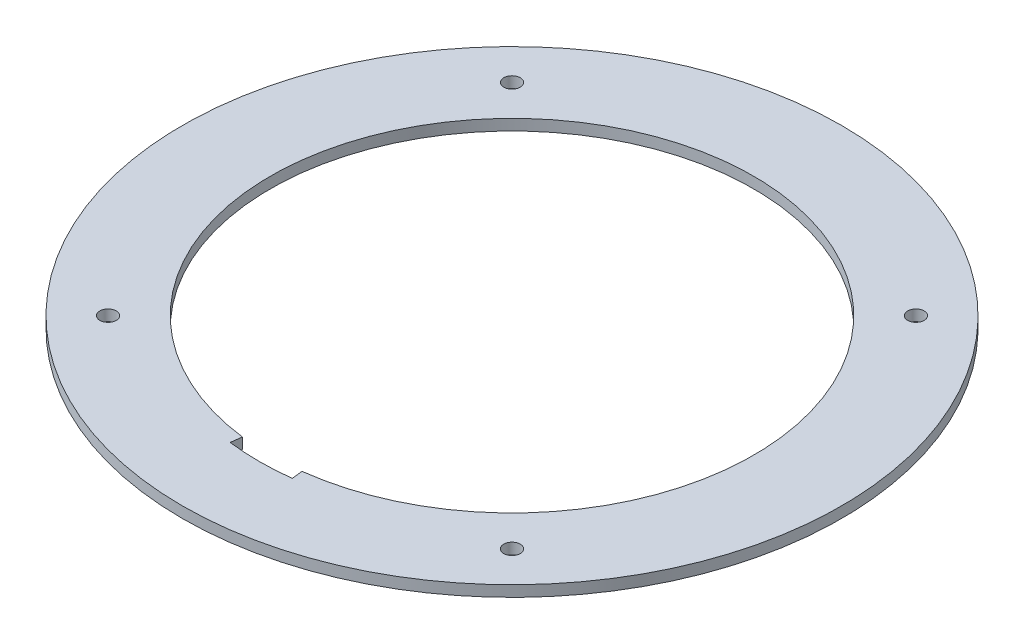
ISO-10303-21;
HEADER;
FILE_DESCRIPTION(('STEP AP214'),'2;1');
FILE_NAME('part.step','',(''),(''),'','','');
FILE_SCHEMA(('AUTOMOTIVE_DESIGN { 1 0 10303 214 1 1 1 1 }'));
ENDSEC;
DATA;
#1=APPLICATION_CONTEXT('core data for automotive mechanical design processes');
#2=APPLICATION_PROTOCOL_DEFINITION('international standard','automotive_design',2000,#1);
#3=PRODUCT_CONTEXT('',#1,'mechanical');
#4=PRODUCT('Part','Part','',(#3));
#5=PRODUCT_RELATED_PRODUCT_CATEGORY('part','',(#4));
#6=PRODUCT_DEFINITION_FORMATION('','',#4);
#7=PRODUCT_DEFINITION_CONTEXT('part definition',#1,'design');
#8=PRODUCT_DEFINITION('design','',#6,#7);
#9=PRODUCT_DEFINITION_SHAPE('','',#8);
#10=(LENGTH_UNIT() NAMED_UNIT(*) SI_UNIT(.MILLI.,.METRE.));
#11=(NAMED_UNIT(*) PLANE_ANGLE_UNIT() SI_UNIT($,.RADIAN.));
#12=(NAMED_UNIT(*) SI_UNIT($,.STERADIAN.) SOLID_ANGLE_UNIT());
#13=UNCERTAINTY_MEASURE_WITH_UNIT(LENGTH_MEASURE(1.E-05),#10,'distance_accuracy_value','');
#14=(GEOMETRIC_REPRESENTATION_CONTEXT(3) GLOBAL_UNCERTAINTY_ASSIGNED_CONTEXT((#13)) GLOBAL_UNIT_ASSIGNED_CONTEXT((#10,
#11,#12)) REPRESENTATION_CONTEXT('',''));
#15=CARTESIAN_POINT('',(0.,0.,0.));
#16=DIRECTION('',(0.,0.,1.));
#17=DIRECTION('',(1.,0.,0.));
#18=AXIS2_PLACEMENT_3D('',#15,#16,#17);
#19=CARTESIAN_POINT('',(0.,-2.,0.));
#20=DIRECTION('',(0.,1.,0.));
#21=DIRECTION('',(0.,0.,1.));
#22=AXIS2_PLACEMENT_3D('',#19,#20,#21);
#23=CYLINDRICAL_SURFACE('',#22,60.);
#24=CARTESIAN_POINT('',(0.,-2.,0.));
#25=DIRECTION('',(0.,1.,0.));
#26=DIRECTION('',(0.,0.,1.));
#27=AXIS2_PLACEMENT_3D('',#24,#25,#26);
#28=CIRCLE('',#27,60.);
#29=CARTESIAN_POINT('',(0.,-2.,60.));
#30=VERTEX_POINT('',#29);
#31=EDGE_CURVE('E11',#30,#30,#28,.T.);
#32=ORIENTED_EDGE('',*,*,#31,.T.);
#33=EDGE_LOOP('',(#32));
#34=FACE_BOUND('',#33,.T.);
#35=CARTESIAN_POINT('',(0.,0.,0.));
#36=DIRECTION('',(0.,1.,0.));
#37=DIRECTION('',(0.,0.,1.));
#38=AXIS2_PLACEMENT_3D('',#35,#36,#37);
#39=CIRCLE('',#38,60.);
#40=CARTESIAN_POINT('',(0.,0.,60.));
#41=VERTEX_POINT('',#40);
#42=EDGE_CURVE('E44',#41,#41,#39,.T.);
#43=ORIENTED_EDGE('',*,*,#42,.F.);
#44=EDGE_LOOP('',(#43));
#45=FACE_BOUND('',#44,.T.);
#46=ADVANCED_FACE('F41',(#34,#45),#23,.T.);
#47=CARTESIAN_POINT('',(0.,-2.,0.));
#48=DIRECTION('',(0.,1.,0.));
#49=DIRECTION('',(0.,0.,1.));
#50=AXIS2_PLACEMENT_3D('',#47,#48,#49);
#51=PLANE('',#50);
#52=CARTESIAN_POINT('',(-36.7695526217005,-2.,-36.7695526217005));
#53=DIRECTION('',(0.,1.,0.));
#54=DIRECTION('',(0.,0.,1.));
#55=AXIS2_PLACEMENT_3D('',#52,#53,#54);
#56=CIRCLE('',#55,1.5);
#57=CARTESIAN_POINT('',(-36.7695526217005,-2.,-35.2695526217005));
#58=VERTEX_POINT('',#57);
#59=EDGE_CURVE('E197',#58,#58,#56,.F.);
#60=ORIENTED_EDGE('',*,*,#59,.F.);
#61=EDGE_LOOP('',(#60));
#62=FACE_BOUND('',#61,.T.);
#63=CARTESIAN_POINT('',(36.7695526217005,-2.,36.7695526217005));
#64=DIRECTION('',(0.,1.,0.));
#65=DIRECTION('',(0.,0.,1.));
#66=AXIS2_PLACEMENT_3D('',#63,#64,#65);
#67=CIRCLE('',#66,1.5);
#68=CARTESIAN_POINT('',(36.7695526217005,-2.,38.2695526217005));
#69=VERTEX_POINT('',#68);
#70=EDGE_CURVE('E203',#69,#69,#67,.F.);
#71=ORIENTED_EDGE('',*,*,#70,.F.);
#72=EDGE_LOOP('',(#71));
#73=FACE_BOUND('',#72,.T.);
#74=CARTESIAN_POINT('',(-36.7695526217005,-2.,36.7695526217005));
#75=DIRECTION('',(0.,1.,0.));
#76=DIRECTION('',(0.,0.,1.));
#77=AXIS2_PLACEMENT_3D('',#74,#75,#76);
#78=CIRCLE('',#77,1.5);
#79=CARTESIAN_POINT('',(-36.7695526217005,-2.,38.2695526217005));
#80=VERTEX_POINT('',#79);
#81=EDGE_CURVE('E211',#80,#80,#78,.F.);
#82=ORIENTED_EDGE('',*,*,#81,.F.);
#83=EDGE_LOOP('',(#82));
#84=FACE_BOUND('',#83,.T.);
#85=CARTESIAN_POINT('',(36.7695526217005,-2.,-36.7695526217005));
#86=DIRECTION('',(0.,1.,0.));
#87=DIRECTION('',(0.,0.,1.));
#88=AXIS2_PLACEMENT_3D('',#85,#86,#87);
#89=CIRCLE('',#88,1.5);
#90=CARTESIAN_POINT('',(36.7695526217005,-2.,-35.2695526217005));
#91=VERTEX_POINT('',#90);
#92=EDGE_CURVE('E110',#91,#91,#89,.F.);
#93=ORIENTED_EDGE('',*,*,#92,.F.);
#94=EDGE_LOOP('',(#93));
#95=FACE_BOUND('',#94,.T.);
#96=DIRECTION('',(-0.123101981596663,0.,0.992394025640509));
#97=VECTOR('',#96,1.);
#98=CARTESIAN_POINT('',(-5.66269115344654,-2.,45.6501251794634));
#99=LINE('',#98,#97);
#100=CARTESIAN_POINT('',(-5.41648719025322,-2.,43.6653371281824));
#101=VERTEX_POINT('',#100);
#102=CARTESIAN_POINT('',(-5.66269115344654,-2.,45.6501251794634));
#103=VERTEX_POINT('',#102);
#104=EDGE_CURVE('E91',#101,#103,#99,.T.);
#105=ORIENTED_EDGE('',*,*,#104,.T.);
#106=CARTESIAN_POINT('',(0.,-2.,0.));
#107=DIRECTION('',(0.,1.,0.));
#108=DIRECTION('',(0.,0.,-1.));
#109=AXIS2_PLACEMENT_3D('',#106,#107,#108);
#110=CIRCLE('',#109,46.);
#111=CARTESIAN_POINT('',(5.66337383484554,-2.,45.6500404907464));
#112=VERTEX_POINT('',#111);
#113=EDGE_CURVE('E84',#103,#112,#110,.T.);
#114=ORIENTED_EDGE('',*,*,#113,.T.);
#115=DIRECTION('',(-0.123116822496641,0.,-0.992392184581444));
#116=VECTOR('',#115,1.);
#117=CARTESIAN_POINT('',(5.66337383484554,-2.,45.6500404907464));
#118=LINE('',#117,#116);
#119=CARTESIAN_POINT('',(5.41714018985226,-2.,43.6652561215835));
#120=VERTEX_POINT('',#119);
#121=EDGE_CURVE('E94',#112,#120,#118,.T.);
#122=ORIENTED_EDGE('',*,*,#121,.T.);
#123=CARTESIAN_POINT('',(0.,-2.,0.));
#124=DIRECTION('',(0.,1.,0.));
#125=DIRECTION('',(0.,0.,1.));
#126=AXIS2_PLACEMENT_3D('',#123,#124,#125);
#127=CIRCLE('',#126,44.);
#128=EDGE_CURVE('E56',#120,#101,#127,.T.);
#129=ORIENTED_EDGE('',*,*,#128,.T.);
#130=EDGE_LOOP('',(#105,#114,#122,#129));
#131=FACE_BOUND('',#130,.T.);
#132=ORIENTED_EDGE('',*,*,#31,.F.);
#133=EDGE_LOOP('',(#132));
#134=FACE_BOUND('',#133,.T.);
#135=ADVANCED_FACE('F99',(#62,#73,#84,#95,#131,#134),#51,.F.);
#136=CARTESIAN_POINT('',(0.,0.,0.));
#137=DIRECTION('',(0.,1.,0.));
#138=DIRECTION('',(0.,0.,1.));
#139=AXIS2_PLACEMENT_3D('',#136,#137,#138);
#140=PLANE('',#139);
#141=CARTESIAN_POINT('',(-36.7695526217005,0.,-36.7695526217005));
#142=DIRECTION('',(0.,1.,0.));
#143=DIRECTION('',(0.,0.,1.));
#144=AXIS2_PLACEMENT_3D('',#141,#142,#143);
#145=CIRCLE('',#144,1.5);
#146=CARTESIAN_POINT('',(-36.7695526217005,0.,-35.2695526217005));
#147=VERTEX_POINT('',#146);
#148=EDGE_CURVE('E194',#147,#147,#145,.T.);
#149=ORIENTED_EDGE('',*,*,#148,.F.);
#150=EDGE_LOOP('',(#149));
#151=FACE_BOUND('',#150,.T.);
#152=CARTESIAN_POINT('',(36.7695526217005,0.,36.7695526217005));
#153=DIRECTION('',(0.,1.,0.));
#154=DIRECTION('',(0.,0.,-1.));
#155=AXIS2_PLACEMENT_3D('',#152,#153,#154);
#156=CIRCLE('',#155,1.5);
#157=CARTESIAN_POINT('',(36.7695526217005,0.,35.2695526217005));
#158=VERTEX_POINT('',#157);
#159=EDGE_CURVE('E207',#158,#158,#156,.T.);
#160=ORIENTED_EDGE('',*,*,#159,.F.);
#161=EDGE_LOOP('',(#160));
#162=FACE_BOUND('',#161,.T.);
#163=CARTESIAN_POINT('',(-36.7695526217005,0.,36.7695526217005));
#164=DIRECTION('',(0.,1.,0.));
#165=DIRECTION('',(0.,0.,-1.));
#166=AXIS2_PLACEMENT_3D('',#163,#164,#165);
#167=CIRCLE('',#166,1.5);
#168=CARTESIAN_POINT('',(-36.7695526217005,0.,35.2695526217005));
#169=VERTEX_POINT('',#168);
#170=EDGE_CURVE('E226',#169,#169,#167,.T.);
#171=ORIENTED_EDGE('',*,*,#170,.F.);
#172=EDGE_LOOP('',(#171));
#173=FACE_BOUND('',#172,.T.);
#174=CARTESIAN_POINT('',(36.7695526217005,0.,-36.7695526217005));
#175=DIRECTION('',(0.,1.,0.));
#176=DIRECTION('',(0.,0.,1.));
#177=AXIS2_PLACEMENT_3D('',#174,#175,#176);
#178=CIRCLE('',#177,1.5);
#179=CARTESIAN_POINT('',(36.7695526217005,0.,-35.2695526217005));
#180=VERTEX_POINT('',#179);
#181=EDGE_CURVE('E199',#180,#180,#178,.T.);
#182=ORIENTED_EDGE('',*,*,#181,.F.);
#183=EDGE_LOOP('',(#182));
#184=FACE_BOUND('',#183,.T.);
#185=CARTESIAN_POINT('',(0.,0.,0.));
#186=DIRECTION('',(0.,1.,0.));
#187=DIRECTION('',(0.,0.,-1.));
#188=AXIS2_PLACEMENT_3D('',#185,#186,#187);
#189=CIRCLE('',#188,46.);
#190=CARTESIAN_POINT('',(-5.66269115344654,0.,45.6501251794634));
#191=VERTEX_POINT('',#190);
#192=CARTESIAN_POINT('',(5.66337383484554,0.,45.6500404907464));
#193=VERTEX_POINT('',#192);
#194=EDGE_CURVE('E64',#191,#193,#189,.T.);
#195=ORIENTED_EDGE('',*,*,#194,.F.);
#196=DIRECTION('',(-0.123101981596663,0.,0.992394025640509));
#197=VECTOR('',#196,1.);
#198=CARTESIAN_POINT('',(-5.66269115344654,0.,45.6501251794634));
#199=LINE('',#198,#197);
#200=CARTESIAN_POINT('',(-5.41648719025322,0.,43.6653371281824));
#201=VERTEX_POINT('',#200);
#202=EDGE_CURVE('E103',#201,#191,#199,.T.);
#203=ORIENTED_EDGE('',*,*,#202,.F.);
#204=CARTESIAN_POINT('',(0.,0.,0.));
#205=DIRECTION('',(0.,1.,0.));
#206=DIRECTION('',(0.,0.,1.));
#207=AXIS2_PLACEMENT_3D('',#204,#205,#206);
#208=CIRCLE('',#207,44.);
#209=CARTESIAN_POINT('',(5.41714018985225,0.,43.6652561215835));
#210=VERTEX_POINT('',#209);
#211=EDGE_CURVE('E107',#210,#201,#208,.T.);
#212=ORIENTED_EDGE('',*,*,#211,.F.);
#213=DIRECTION('',(-0.123116822496641,0.,-0.992392184581444));
#214=VECTOR('',#213,1.);
#215=CARTESIAN_POINT('',(5.66337383484554,0.,45.6500404907464));
#216=LINE('',#215,#214);
#217=EDGE_CURVE('E119',#193,#210,#216,.T.);
#218=ORIENTED_EDGE('',*,*,#217,.F.);
#219=EDGE_LOOP('',(#195,#203,#212,#218));
#220=FACE_BOUND('',#219,.T.);
#221=ORIENTED_EDGE('',*,*,#42,.T.);
#222=EDGE_LOOP('',(#221));
#223=FACE_BOUND('',#222,.T.);
#224=ADVANCED_FACE('F136',(#151,#162,#173,#184,#220,#223),#140,.T.);
#225=CARTESIAN_POINT('',(0.,-2.,0.));
#226=DIRECTION('',(0.,1.,0.));
#227=DIRECTION('',(0.,0.,1.));
#228=AXIS2_PLACEMENT_3D('',#225,#226,#227);
#229=CYLINDRICAL_SURFACE('',#228,46.);
#230=ORIENTED_EDGE('',*,*,#194,.T.);
#231=DIRECTION('',(0.,1.,0.));
#232=VECTOR('',#231,1.);
#233=CARTESIAN_POINT('',(5.66337383484554,-2.,45.6500404907464));
#234=LINE('',#233,#232);
#235=EDGE_CURVE('E80',#112,#193,#234,.T.);
#236=ORIENTED_EDGE('',*,*,#235,.F.);
#237=ORIENTED_EDGE('',*,*,#113,.F.);
#238=DIRECTION('',(0.,1.,0.));
#239=VECTOR('',#238,1.);
#240=CARTESIAN_POINT('',(-5.66269115344654,-2.,45.6501251794634));
#241=LINE('',#240,#239);
#242=EDGE_CURVE('E125',#103,#191,#241,.T.);
#243=ORIENTED_EDGE('',*,*,#242,.T.);
#244=EDGE_LOOP('',(#230,#236,#237,#243));
#245=FACE_BOUND('',#244,.T.);
#246=ADVANCED_FACE('F82',(#245),#229,.F.);
#247=CARTESIAN_POINT('',(-5.66269115344654,-2.,45.6501251794634));
#248=DIRECTION('',(-0.992394025640509,0.,-0.123101981596663));
#249=DIRECTION('',(-0.123101981596663,0.,0.992394025640509));
#250=AXIS2_PLACEMENT_3D('',#247,#248,#249);
#251=PLANE('',#250);
#252=ORIENTED_EDGE('',*,*,#202,.T.);
#253=ORIENTED_EDGE('',*,*,#242,.F.);
#254=ORIENTED_EDGE('',*,*,#104,.F.);
#255=DIRECTION('',(0.,1.,0.));
#256=VECTOR('',#255,1.);
#257=CARTESIAN_POINT('',(-5.41648719025322,-2.,43.6653371281824));
#258=LINE('',#257,#256);
#259=EDGE_CURVE('E128',#101,#201,#258,.T.);
#260=ORIENTED_EDGE('',*,*,#259,.T.);
#261=EDGE_LOOP('',(#252,#253,#254,#260));
#262=FACE_BOUND('',#261,.T.);
#263=ADVANCED_FACE('F139',(#262),#251,.F.);
#264=CARTESIAN_POINT('',(0.,-2.,0.));
#265=DIRECTION('',(0.,1.,0.));
#266=DIRECTION('',(0.,0.,1.));
#267=AXIS2_PLACEMENT_3D('',#264,#265,#266);
#268=CYLINDRICAL_SURFACE('',#267,44.);
#269=ORIENTED_EDGE('',*,*,#211,.T.);
#270=ORIENTED_EDGE('',*,*,#259,.F.);
#271=ORIENTED_EDGE('',*,*,#128,.F.);
#272=DIRECTION('',(0.,1.,0.));
#273=VECTOR('',#272,1.);
#274=CARTESIAN_POINT('',(5.41714018985225,-2.,43.6652561215835));
#275=LINE('',#274,#273);
#276=EDGE_CURVE('E90',#120,#210,#275,.T.);
#277=ORIENTED_EDGE('',*,*,#276,.T.);
#278=EDGE_LOOP('',(#269,#270,#271,#277));
#279=FACE_BOUND('',#278,.T.);
#280=ADVANCED_FACE('F132',(#279),#268,.F.);
#281=CARTESIAN_POINT('',(5.66337383484554,-2.,45.6500404907464));
#282=DIRECTION('',(0.992392184581444,0.,-0.123116822496641));
#283=DIRECTION('',(-0.123116822496641,0.,-0.992392184581444));
#284=AXIS2_PLACEMENT_3D('',#281,#282,#283);
#285=PLANE('',#284);
#286=ORIENTED_EDGE('',*,*,#217,.T.);
#287=ORIENTED_EDGE('',*,*,#276,.F.);
#288=ORIENTED_EDGE('',*,*,#121,.F.);
#289=ORIENTED_EDGE('',*,*,#235,.T.);
#290=EDGE_LOOP('',(#286,#287,#288,#289));
#291=FACE_BOUND('',#290,.T.);
#292=ADVANCED_FACE('F95',(#291),#285,.F.);
#293=CARTESIAN_POINT('',(36.7695526217005,-2.001,-36.7695526217005));
#294=DIRECTION('',(0.,1.,0.));
#295=DIRECTION('',(0.,0.,1.));
#296=AXIS2_PLACEMENT_3D('',#293,#294,#295);
#297=CYLINDRICAL_SURFACE('',#296,1.5);
#298=ORIENTED_EDGE('',*,*,#181,.T.);
#299=EDGE_LOOP('',(#298));
#300=FACE_BOUND('',#299,.T.);
#301=ORIENTED_EDGE('',*,*,#92,.T.);
#302=EDGE_LOOP('',(#301));
#303=FACE_BOUND('',#302,.T.);
#304=ADVANCED_FACE('F169',(#300,#303),#297,.F.);
#305=CARTESIAN_POINT('',(-36.7695526217005,-2.001,36.7695526217005));
#306=DIRECTION('',(0.,1.,0.));
#307=DIRECTION('',(0.,0.,1.));
#308=AXIS2_PLACEMENT_3D('',#305,#306,#307);
#309=CYLINDRICAL_SURFACE('',#308,1.5);
#310=ORIENTED_EDGE('',*,*,#170,.T.);
#311=EDGE_LOOP('',(#310));
#312=FACE_BOUND('',#311,.T.);
#313=ORIENTED_EDGE('',*,*,#81,.T.);
#314=EDGE_LOOP('',(#313));
#315=FACE_BOUND('',#314,.T.);
#316=ADVANCED_FACE('F173',(#312,#315),#309,.F.);
#317=CARTESIAN_POINT('',(36.7695526217005,-2.001,36.7695526217005));
#318=DIRECTION('',(0.,1.,0.));
#319=DIRECTION('',(0.,0.,1.));
#320=AXIS2_PLACEMENT_3D('',#317,#318,#319);
#321=CYLINDRICAL_SURFACE('',#320,1.5);
#322=ORIENTED_EDGE('',*,*,#159,.T.);
#323=EDGE_LOOP('',(#322));
#324=FACE_BOUND('',#323,.T.);
#325=ORIENTED_EDGE('',*,*,#70,.T.);
#326=EDGE_LOOP('',(#325));
#327=FACE_BOUND('',#326,.T.);
#328=ADVANCED_FACE('F178',(#324,#327),#321,.F.);
#329=CARTESIAN_POINT('',(-36.7695526217005,-2.001,-36.7695526217005));
#330=DIRECTION('',(0.,1.,0.));
#331=DIRECTION('',(0.,0.,1.));
#332=AXIS2_PLACEMENT_3D('',#329,#330,#331);
#333=CYLINDRICAL_SURFACE('',#332,1.5);
#334=ORIENTED_EDGE('',*,*,#148,.T.);
#335=EDGE_LOOP('',(#334));
#336=FACE_BOUND('',#335,.T.);
#337=ORIENTED_EDGE('',*,*,#59,.T.);
#338=EDGE_LOOP('',(#337));
#339=FACE_BOUND('',#338,.T.);
#340=ADVANCED_FACE('F186',(#336,#339),#333,.F.);
#341=CLOSED_SHELL('',(#46,#135,#224,#246,#263,#280,#292,#304,#316,#328,#340));
#342=MANIFOLD_SOLID_BREP('B2',#341);
#343=ADVANCED_BREP_SHAPE_REPRESENTATION('',(#18,#342),#14);
#344=SHAPE_DEFINITION_REPRESENTATION(#9,#343);
ENDSEC;
END-ISO-10303-21;
